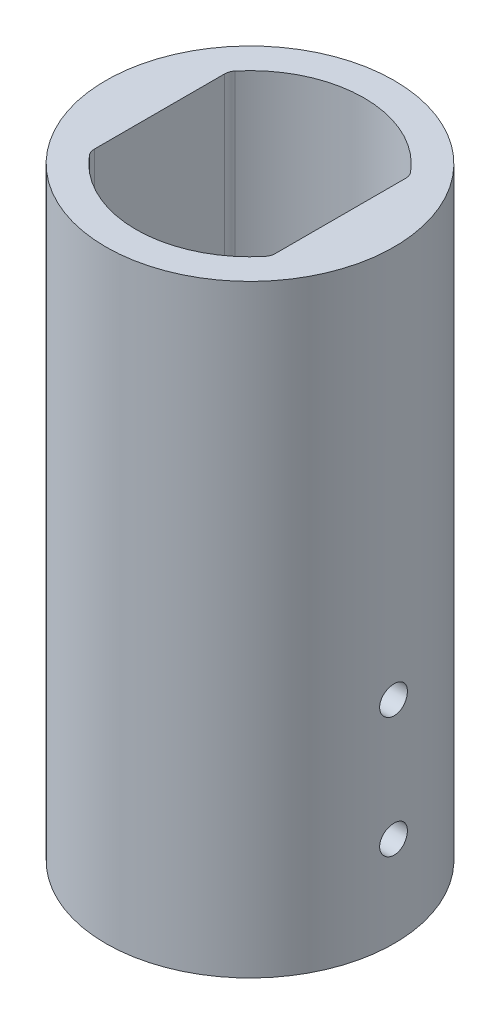
ISO-10303-21;
HEADER;
FILE_DESCRIPTION(('STEP AP214'),'2;1');
FILE_NAME('part.step','',(''),(''),'','','');
FILE_SCHEMA(('AUTOMOTIVE_DESIGN { 1 0 10303 214 1 1 1 1 }'));
ENDSEC;
DATA;
#1=APPLICATION_CONTEXT('core data for automotive mechanical design processes');
#2=APPLICATION_PROTOCOL_DEFINITION('international standard','automotive_design',2000,#1);
#3=PRODUCT_CONTEXT('',#1,'mechanical');
#4=PRODUCT('Part','Part','',(#3));
#5=PRODUCT_RELATED_PRODUCT_CATEGORY('part','',(#4));
#6=PRODUCT_DEFINITION_FORMATION('','',#4);
#7=PRODUCT_DEFINITION_CONTEXT('part definition',#1,'design');
#8=PRODUCT_DEFINITION('design','',#6,#7);
#9=PRODUCT_DEFINITION_SHAPE('','',#8);
#10=(LENGTH_UNIT() NAMED_UNIT(*) SI_UNIT(.MILLI.,.METRE.));
#11=(NAMED_UNIT(*) PLANE_ANGLE_UNIT() SI_UNIT($,.RADIAN.));
#12=(NAMED_UNIT(*) SI_UNIT($,.STERADIAN.) SOLID_ANGLE_UNIT());
#13=UNCERTAINTY_MEASURE_WITH_UNIT(LENGTH_MEASURE(1.E-05),#10,'distance_accuracy_value','');
#14=(GEOMETRIC_REPRESENTATION_CONTEXT(3) GLOBAL_UNCERTAINTY_ASSIGNED_CONTEXT((#13)) GLOBAL_UNIT_ASSIGNED_CONTEXT((#10,
#11,#12)) REPRESENTATION_CONTEXT('',''));
#15=CARTESIAN_POINT('',(0.,0.,0.));
#16=DIRECTION('',(0.,0.,1.));
#17=DIRECTION('',(1.,0.,0.));
#18=AXIS2_PLACEMENT_3D('',#15,#16,#17);
#19=CARTESIAN_POINT('',(0.,100.,0.));
#20=DIRECTION('',(0.,-1.,0.));
#21=DIRECTION('',(0.,0.,-1.));
#22=AXIS2_PLACEMENT_3D('',#19,#20,#21);
#23=CYLINDRICAL_SURFACE('',#22,18.9);
#24=CARTESIAN_POINT('',(0.,0.,0.));
#25=DIRECTION('',(0.,1.,0.));
#26=DIRECTION('',(0.,0.,1.));
#27=AXIS2_PLACEMENT_3D('',#24,#25,#26);
#28=CIRCLE('',#27,18.9);
#29=CARTESIAN_POINT('',(-14.5384615384615,0.,12.0765531545501));
#30=VERTEX_POINT('',#29);
#31=CARTESIAN_POINT('',(14.5384615384615,0.,12.0765531545501));
#32=VERTEX_POINT('',#31);
#33=EDGE_CURVE('E133',#30,#32,#28,.T.);
#34=ORIENTED_EDGE('',*,*,#33,.F.);
#35=DIRECTION('',(0.,-1.,0.));
#36=VECTOR('',#35,1.);
#37=CARTESIAN_POINT('',(-14.5384615384615,100.,12.0765531545501));
#38=LINE('',#37,#36);
#39=CARTESIAN_POINT('',(-14.5384615384615,100.,12.0765531545501));
#40=VERTEX_POINT('',#39);
#41=EDGE_CURVE('E157',#30,#40,#38,.F.);
#42=ORIENTED_EDGE('',*,*,#41,.T.);
#43=CARTESIAN_POINT('',(0.,100.,0.));
#44=DIRECTION('',(0.,1.,0.));
#45=DIRECTION('',(0.,0.,1.));
#46=AXIS2_PLACEMENT_3D('',#43,#44,#45);
#47=CIRCLE('',#46,18.9);
#48=CARTESIAN_POINT('',(14.5384615384615,100.,12.0765531545501));
#49=VERTEX_POINT('',#48);
#50=EDGE_CURVE('E209',#40,#49,#47,.T.);
#51=ORIENTED_EDGE('',*,*,#50,.T.);
#52=DIRECTION('',(0.,-1.,0.));
#53=VECTOR('',#52,1.);
#54=CARTESIAN_POINT('',(14.5384615384615,100.,12.0765531545501));
#55=LINE('',#54,#53);
#56=EDGE_CURVE('E142',#49,#32,#55,.T.);
#57=ORIENTED_EDGE('',*,*,#56,.T.);
#58=EDGE_LOOP('',(#34,#42,#51,#57));
#59=FACE_BOUND('',#58,.T.);
#60=ADVANCED_FACE('F43',(#59),#23,.F.);
#61=CARTESIAN_POINT('',(-15.,100.,0.));
#62=DIRECTION('',(1.,0.,0.));
#63=DIRECTION('',(0.,0.,-1.));
#64=AXIS2_PLACEMENT_3D('',#61,#62,#63);
#65=PLANE('',#64);
#66=CARTESIAN_POINT('',(-15.,15.,0.));
#67=DIRECTION('',(1.,0.,0.));
#68=DIRECTION('',(0.,0.,-1.));
#69=AXIS2_PLACEMENT_3D('',#66,#67,#68);
#70=CIRCLE('',#69,2.3);
#71=CARTESIAN_POINT('',(-15.,15.,-2.3));
#72=VERTEX_POINT('',#71);
#73=EDGE_CURVE('E282',#72,#72,#70,.T.);
#74=ORIENTED_EDGE('',*,*,#73,.F.);
#75=EDGE_LOOP('',(#74));
#76=FACE_BOUND('',#75,.T.);
#77=CARTESIAN_POINT('',(-15.,35.,0.));
#78=DIRECTION('',(1.,0.,0.));
#79=DIRECTION('',(0.,0.,-1.));
#80=AXIS2_PLACEMENT_3D('',#77,#78,#79);
#81=CIRCLE('',#80,2.3);
#82=CARTESIAN_POINT('',(-15.,35.,-2.3));
#83=VERTEX_POINT('',#82);
#84=EDGE_CURVE('E274',#83,#83,#81,.T.);
#85=ORIENTED_EDGE('',*,*,#84,.F.);
#86=EDGE_LOOP('',(#85));
#87=FACE_BOUND('',#86,.T.);
#88=DIRECTION('',(0.,0.,1.));
#89=VECTOR('',#88,1.);
#90=CARTESIAN_POINT('',(-15.,100.,0.));
#91=LINE('',#90,#89);
#92=CARTESIAN_POINT('',(-15.,100.,-10.7986110217935));
#93=VERTEX_POINT('',#92);
#94=CARTESIAN_POINT('',(-15.,100.,10.7986110217935));
#95=VERTEX_POINT('',#94);
#96=EDGE_CURVE('E207',#93,#95,#91,.T.);
#97=ORIENTED_EDGE('',*,*,#96,.T.);
#98=DIRECTION('',(0.,1.,0.));
#99=VECTOR('',#98,1.);
#100=CARTESIAN_POINT('',(-15.,0.,10.7986110217935));
#101=LINE('',#100,#99);
#102=CARTESIAN_POINT('',(-15.,0.,10.7986110217935));
#103=VERTEX_POINT('',#102);
#104=EDGE_CURVE('E131',#95,#103,#101,.F.);
#105=ORIENTED_EDGE('',*,*,#104,.T.);
#106=DIRECTION('',(0.,0.,1.));
#107=VECTOR('',#106,1.);
#108=CARTESIAN_POINT('',(-15.,0.,0.));
#109=LINE('',#108,#107);
#110=CARTESIAN_POINT('',(-15.,0.,-10.7986110217935));
#111=VERTEX_POINT('',#110);
#112=EDGE_CURVE('E113',#111,#103,#109,.T.);
#113=ORIENTED_EDGE('',*,*,#112,.F.);
#114=DIRECTION('',(0.,1.,0.));
#115=VECTOR('',#114,1.);
#116=CARTESIAN_POINT('',(-15.,100.,-10.7986110217935));
#117=LINE('',#116,#115);
#118=EDGE_CURVE('E128',#111,#93,#117,.T.);
#119=ORIENTED_EDGE('',*,*,#118,.T.);
#120=EDGE_LOOP('',(#97,#105,#113,#119));
#121=FACE_BOUND('',#120,.T.);
#122=ADVANCED_FACE('F127',(#76,#87,#121),#65,.T.);
#123=CARTESIAN_POINT('',(14.5384615384615,100.,-12.0765531545501));
#124=VERTEX_POINT('',#123);
#125=CARTESIAN_POINT('',(-14.5384615384615,100.,-12.0765531545501));
#126=VERTEX_POINT('',#125);
#127=EDGE_CURVE('E200',#124,#126,#47,.T.);
#128=ORIENTED_EDGE('',*,*,#127,.T.);
#129=DIRECTION('',(0.,-1.,0.));
#130=VECTOR('',#129,1.);
#131=CARTESIAN_POINT('',(-14.5384615384615,100.,-12.0765531545501));
#132=LINE('',#131,#130);
#133=CARTESIAN_POINT('',(-14.5384615384615,0.,-12.0765531545501));
#134=VERTEX_POINT('',#133);
#135=EDGE_CURVE('E163',#126,#134,#132,.T.);
#136=ORIENTED_EDGE('',*,*,#135,.T.);
#137=CARTESIAN_POINT('',(14.5384615384615,0.,-12.0765531545501));
#138=VERTEX_POINT('',#137);
#139=EDGE_CURVE('E115',#138,#134,#28,.T.);
#140=ORIENTED_EDGE('',*,*,#139,.F.);
#141=DIRECTION('',(0.,-1.,0.));
#142=VECTOR('',#141,1.);
#143=CARTESIAN_POINT('',(14.5384615384615,100.,-12.0765531545501));
#144=LINE('',#143,#142);
#145=EDGE_CURVE('E160',#138,#124,#144,.F.);
#146=ORIENTED_EDGE('',*,*,#145,.T.);
#147=EDGE_LOOP('',(#128,#136,#140,#146));
#148=FACE_BOUND('',#147,.T.);
#149=ADVANCED_FACE('F192',(#148),#23,.F.);
#150=CARTESIAN_POINT('',(15.,100.,0.));
#151=DIRECTION('',(1.,0.,0.));
#152=DIRECTION('',(0.,0.,-1.));
#153=AXIS2_PLACEMENT_3D('',#150,#151,#152);
#154=PLANE('',#153);
#155=CARTESIAN_POINT('',(15.,15.,0.));
#156=DIRECTION('',(1.,0.,0.));
#157=DIRECTION('',(0.,0.,-1.));
#158=AXIS2_PLACEMENT_3D('',#155,#156,#157);
#159=CIRCLE('',#158,2.3);
#160=CARTESIAN_POINT('',(15.,15.,-2.3));
#161=VERTEX_POINT('',#160);
#162=EDGE_CURVE('E268',#161,#161,#159,.T.);
#163=ORIENTED_EDGE('',*,*,#162,.T.);
#164=EDGE_LOOP('',(#163));
#165=FACE_BOUND('',#164,.T.);
#166=CARTESIAN_POINT('',(15.,35.,0.));
#167=DIRECTION('',(1.,0.,0.));
#168=DIRECTION('',(0.,0.,-1.));
#169=AXIS2_PLACEMENT_3D('',#166,#167,#168);
#170=CIRCLE('',#169,2.3);
#171=CARTESIAN_POINT('',(15.,35.,-2.3));
#172=VERTEX_POINT('',#171);
#173=EDGE_CURVE('E271',#172,#172,#170,.T.);
#174=ORIENTED_EDGE('',*,*,#173,.T.);
#175=EDGE_LOOP('',(#174));
#176=FACE_BOUND('',#175,.T.);
#177=DIRECTION('',(0.,0.,1.));
#178=VECTOR('',#177,1.);
#179=CARTESIAN_POINT('',(15.,0.,0.));
#180=LINE('',#179,#178);
#181=CARTESIAN_POINT('',(15.,0.,-10.7986110217935));
#182=VERTEX_POINT('',#181);
#183=CARTESIAN_POINT('',(15.,0.,10.7986110217935));
#184=VERTEX_POINT('',#183);
#185=EDGE_CURVE('E186',#182,#184,#180,.T.);
#186=ORIENTED_EDGE('',*,*,#185,.T.);
#187=DIRECTION('',(0.,-1.,0.));
#188=VECTOR('',#187,1.);
#189=CARTESIAN_POINT('',(15.,100.,10.7986110217935));
#190=LINE('',#189,#188);
#191=CARTESIAN_POINT('',(15.,100.,10.7986110217935));
#192=VERTEX_POINT('',#191);
#193=EDGE_CURVE('E59',#184,#192,#190,.F.);
#194=ORIENTED_EDGE('',*,*,#193,.T.);
#195=DIRECTION('',(0.,0.,1.));
#196=VECTOR('',#195,1.);
#197=CARTESIAN_POINT('',(15.,100.,0.));
#198=LINE('',#197,#196);
#199=CARTESIAN_POINT('',(15.,100.,-10.7986110217935));
#200=VERTEX_POINT('',#199);
#201=EDGE_CURVE('E196',#200,#192,#198,.T.);
#202=ORIENTED_EDGE('',*,*,#201,.F.);
#203=DIRECTION('',(0.,-1.,0.));
#204=VECTOR('',#203,1.);
#205=CARTESIAN_POINT('',(15.,100.,-10.7986110217935));
#206=LINE('',#205,#204);
#207=EDGE_CURVE('E166',#200,#182,#206,.T.);
#208=ORIENTED_EDGE('',*,*,#207,.T.);
#209=EDGE_LOOP('',(#186,#194,#202,#208));
#210=FACE_BOUND('',#209,.T.);
#211=ADVANCED_FACE('F195',(#165,#176,#210),#154,.F.);
#212=CARTESIAN_POINT('',(0.,100.,0.));
#213=DIRECTION('',(0.,-1.,0.));
#214=DIRECTION('',(0.,0.,-1.));
#215=AXIS2_PLACEMENT_3D('',#212,#213,#214);
#216=CYLINDRICAL_SURFACE('',#215,23.9);
#217=CARTESIAN_POINT('',(-23.9,12.7,0.));
#218=CARTESIAN_POINT('',(-23.8999985672061,12.7000055929058,-0.128872230972605));
#219=CARTESIAN_POINT('',(-23.8989465690738,12.7108677971494,-0.257830277154595));
#220=CARTESIAN_POINT('',(-23.894851095696,12.7540362637152,-0.512172892748667));
#221=CARTESIAN_POINT('',(-23.8918054114233,12.7863663132309,-0.637553337131763));
#222=CARTESIAN_POINT('',(-23.8840664593269,12.8715221011429,-0.881020662244166));
#223=CARTESIAN_POINT('',(-23.8793741715802,12.9243356494915,-0.999111832573301));
#224=CARTESIAN_POINT('',(-23.8688670628722,13.0489360271797,-1.22472696766789));
#225=CARTESIAN_POINT('',(-23.8630524692661,13.1207190147982,-1.33225306604665));
#226=CARTESIAN_POINT('',(-23.8509306139061,13.2814786551111,-1.53407185173555));
#227=CARTESIAN_POINT('',(-23.8446219390942,13.3705057809238,-1.62832425331403));
#228=CARTESIAN_POINT('',(-23.8322346737059,13.5631190858127,-1.800574045291));
#229=CARTESIAN_POINT('',(-23.8261560936497,13.6667059295513,-1.87857069319784));
#230=CARTESIAN_POINT('',(-23.8149026573076,13.8857485890693,-2.01623625677914));
#231=CARTESIAN_POINT('',(-23.8097295959098,14.0012272730351,-2.07586894568675));
#232=CARTESIAN_POINT('',(-23.8008901453461,14.2406168389981,-2.17488250242813));
#233=CARTESIAN_POINT('',(-23.797223721535,14.3645275270236,-2.21426383595039));
#234=CARTESIAN_POINT('',(-23.7918252562123,14.6168543815431,-2.27153791479931));
#235=CARTESIAN_POINT('',(-23.7900872235024,14.7452553078981,-2.2894972279951));
#236=CARTESIAN_POINT('',(-23.7887236555611,15.00325983418,-2.30362321090833));
#237=CARTESIAN_POINT('',(-23.7890980686512,15.1328634046083,-2.29979041374429));
#238=CARTESIAN_POINT('',(-23.7919116228644,15.3891360270471,-2.27049587663545));
#239=CARTESIAN_POINT('',(-23.7943438332959,15.5158134648615,-2.2451067377578));
#240=CARTESIAN_POINT('',(-23.8009880975228,15.7631007544195,-2.17353314570594));
#241=CARTESIAN_POINT('',(-23.8052001737596,15.8837105296376,-2.12734843033061));
#242=CARTESIAN_POINT('',(-23.8149375522509,16.1156686577129,-2.01541428455724));
#243=CARTESIAN_POINT('',(-23.8204650193691,16.2270013301704,-1.94963255606358));
#244=CARTESIAN_POINT('',(-23.8322085048326,16.4370733667284,-1.8003949117552));
#245=CARTESIAN_POINT('',(-23.8384245418302,16.5358123895318,-1.71693851710729));
#246=CARTESIAN_POINT('',(-23.8508756500325,16.718316231955,-1.53431465458612));
#247=CARTESIAN_POINT('',(-23.8571106954143,16.8020183092965,-1.43508447108696));
#248=CARTESIAN_POINT('',(-23.8688732883478,16.9515862530946,-1.22394783206344));
#249=CARTESIAN_POINT('',(-23.8744008351923,17.0174521017263,-1.11204136387087));
#250=CARTESIAN_POINT('',(-23.8841272489602,17.1294750461368,-0.878685948075916));
#251=CARTESIAN_POINT('',(-23.888325907839,17.1756290563148,-0.75723551002465));
#252=CARTESIAN_POINT('',(-23.8949192911087,17.2468726949626,-0.50825975271132));
#253=CARTESIAN_POINT('',(-23.8973140654489,17.2719629066892,-0.38073460176148));
#254=CARTESIAN_POINT('',(-23.9000234389768,17.3002873583688,-0.123772857945435));
#255=CARTESIAN_POINT('',(-23.9003462803333,17.3036081982201,0.00565410590416365));
#256=CARTESIAN_POINT('',(-23.8988974920686,17.2885269493404,0.263222792596815));
#257=CARTESIAN_POINT('',(-23.8971258886186,17.2701251320455,0.391364531479252));
#258=CARTESIAN_POINT('',(-23.8916926113398,17.2121927571613,0.642476074205561));
#259=CARTESIAN_POINT('',(-23.8880345563822,17.1727026491259,0.765455294830839));
#260=CARTESIAN_POINT('',(-23.8792388908754,17.0737561792389,1.00304333933314));
#261=CARTESIAN_POINT('',(-23.8741012494867,17.0142994012105,1.11765198867688));
#262=CARTESIAN_POINT('',(-23.862900853161,16.8768918926729,1.33563773638552));
#263=CARTESIAN_POINT('',(-23.8568352673294,16.7988841503593,1.438978749535));
#264=CARTESIAN_POINT('',(-23.8444689896744,16.6266709592416,1.63113072589424));
#265=CARTESIAN_POINT('',(-23.8381682923951,16.5324651343695,1.71994135166117));
#266=CARTESIAN_POINT('',(-23.826017215627,16.3301525701799,1.8808113553818));
#267=CARTESIAN_POINT('',(-23.8201684053207,16.2220005920219,1.95281397544649));
#268=CARTESIAN_POINT('',(-23.8096068196382,15.9950893839311,2.07763414337917));
#269=CARTESIAN_POINT('',(-23.8048940297252,15.876330289757,2.13045193674698));
#270=CARTESIAN_POINT('',(-23.797147658773,15.6317721595228,2.21530772630544));
#271=CARTESIAN_POINT('',(-23.7941113309366,15.5059850132577,2.24737972829705));
#272=CARTESIAN_POINT('',(-23.7900529864969,15.2507803123363,2.28994395885938));
#273=CARTESIAN_POINT('',(-23.7890309167667,15.1213628535225,2.30043675659235));
#274=CARTESIAN_POINT('',(-23.7891178496685,14.8631353211539,2.29953715282618));
#275=CARTESIAN_POINT('',(-23.7902181700639,14.7343249247485,2.28823391423022));
#276=CARTESIAN_POINT('',(-23.7944074083354,14.480441726994,2.24424979658284));
#277=CARTESIAN_POINT('',(-23.797496328661,14.3553689302489,2.21156889119876));
#278=CARTESIAN_POINT('',(-23.8053123453428,14.1125104312908,2.12578126174791));
#279=CARTESIAN_POINT('',(-23.8100392507747,13.9947238816745,2.07267691816653));
#280=CARTESIAN_POINT('',(-23.8205990151742,13.7697221387804,1.94755919486644));
#281=CARTESIAN_POINT('',(-23.8264318652658,13.6625068606696,1.87554596690568));
#282=CARTESIAN_POINT('',(-23.8385748500153,13.4612342026992,1.71431960002719));
#283=CARTESIAN_POINT('',(-23.8448867675235,13.3672300987724,1.6250400852698));
#284=CARTESIAN_POINT('',(-23.8572603863862,13.1954972756698,1.43194485048354));
#285=CARTESIAN_POINT('',(-23.8633220273003,13.1177724696101,1.32812564547907));
#286=CARTESIAN_POINT('',(-23.8745267500242,12.9806629745133,1.10863329606027));
#287=CARTESIAN_POINT('',(-23.8796676334151,12.9213219390023,0.992932792273184));
#288=CARTESIAN_POINT('',(-23.8884273297115,12.8229881838717,0.753235507748115));
#289=CARTESIAN_POINT('',(-23.8920478659587,12.7839724130473,0.629248306014286));
#290=CARTESIAN_POINT('',(-23.8964444241465,12.7371757611535,0.420459933415131));
#291=CARTESIAN_POINT('',(-23.8977715833696,12.7232537725771,0.336995471077471));
#292=CARTESIAN_POINT('',(-23.8995498395808,12.7046640749953,0.169032978175776));
#293=CARTESIAN_POINT('',(-23.9000009398546,12.6999963312809,0.0845349514894442));
#294=CARTESIAN_POINT('',(-23.9,12.7,0.));
#295=B_SPLINE_CURVE_WITH_KNOTS('',3,(#217,#218,#219,#220,#221,#222,#223,#224,#225,#226,#227,
#228,#229,#230,#231,#232,#233,#234,#235,#236,#237,#238,#239,#240,#241,#242,#243,#244,#245,#246,
#247,#248,#249,#250,#251,#252,#253,#254,#255,#256,#257,#258,#259,#260,#261,#262,#263,#264,#265,
#266,#267,#268,#269,#270,#271,#272,#273,#274,#275,#276,#277,#278,#279,#280,#281,#282,#283,#284,
#285,#286,#287,#288,#289,#290,#291,#292,#293,#294),.UNSPECIFIED.,.T.,.F.,(4,2,2,2,2,2,2,2,2,2,2,
2,2,2,2,2,2,2,2,2,2,2,2,2,2,2,2,2,2,2,2,2,2,2,2,2,2,2,4),(0.,0.386308013888013,
0.773044787691418,1.15955176072641,1.5459805176616,1.93355791577206,2.32115301284335,
2.70950789572854,3.09785384782918,3.48498986385391,3.87211640908921,4.25794427308729,
4.64377700193387,5.0302491782464,5.41673182600896,5.80479141800497,6.19285139781715,
6.58097210051429,6.96908205578896,7.35564714401819,7.74220740196458,8.12802884607991,
8.513858332594,8.90088925356509,9.28792916137665,9.67625772063646,10.064581310451,
10.4522667494301,10.8399419628819,11.2260346441692,11.6121278010401,11.9981759698586,
12.3842210404465,12.7717807716331,13.1594335553632,13.5479999139015,13.9361246285081,
14.1895279524865,14.4429303260432),.UNSPECIFIED.);
#296=CARTESIAN_POINT('',(-23.9,12.7,0.));
#297=VERTEX_POINT('',#296);
#298=EDGE_CURVE('E138',#297,#297,#295,.T.);
#299=ORIENTED_EDGE('',*,*,#298,.T.);
#300=EDGE_LOOP('',(#299));
#301=FACE_BOUND('',#300,.T.);
#302=CARTESIAN_POINT('',(23.7890731219188,15.,-2.3));
#303=CARTESIAN_POINT('',(23.7890745796133,14.8711293269885,-2.29999440569837));
#304=CARTESIAN_POINT('',(23.790131586134,14.7421728338327,-2.28913245520896));
#305=CARTESIAN_POINT('',(23.7942449506401,14.4878334450125,-2.24596508820164));
#306=CARTESIAN_POINT('',(23.797303526949,14.362454675597,-2.2136358791101));
#307=CARTESIAN_POINT('',(23.8050704428709,14.1189908921669,-2.12848254972182));
#308=CARTESIAN_POINT('',(23.8097777978512,14.0009015743695,-2.0756706594432));
#309=CARTESIAN_POINT('',(23.820310654267,13.7752895430518,-1.95107418634971));
#310=CARTESIAN_POINT('',(23.8261359294674,13.6677646982297,-1.87929344118266));
#311=CARTESIAN_POINT('',(23.8382703165305,13.4659444960032,-1.71853606565482));
#312=CARTESIAN_POINT('',(23.8445808283442,13.3716898216312,-1.62950846122631));
#313=CARTESIAN_POINT('',(23.8569619201748,13.1994356434251,-1.4368932449574));
#314=CARTESIAN_POINT('',(23.863032489325,13.1214368751117,-1.33330497465477));
#315=CARTESIAN_POINT('',(23.8742634170107,12.98376909502,-1.11426106624565));
#316=CARTESIAN_POINT('',(23.8794219877009,12.9241359203515,-0.998782805263267));
#317=CARTESIAN_POINT('',(23.8882324844159,12.8251213488409,-0.759394158676584));
#318=CARTESIAN_POINT('',(23.8918844446569,12.7857394920714,-0.635483964642178));
#319=CARTESIAN_POINT('',(23.8972604262711,12.7284643186578,-0.383158618265516));
#320=CARTESIAN_POINT('',(23.8989904229893,12.7105043887896,-0.254758715742679));
#321=CARTESIAN_POINT('',(23.9003478595699,12.6963768178066,0.00324380621287873));
#322=CARTESIAN_POINT('',(23.8999753502255,12.7002086502374,0.132846396515046));
#323=CARTESIAN_POINT('',(23.8971746464111,12.729501661128,0.38912327673305));
#324=CARTESIAN_POINT('',(23.8947532598505,12.7548912096216,0.51580583889174));
#325=CARTESIAN_POINT('',(23.888134804395,12.8264673975964,0.763103165693198));
#326=CARTESIAN_POINT('',(23.883937713903,12.872654290028,0.883717856514829));
#327=CARTESIAN_POINT('',(23.874228085727,12.9845929411124,1.11568193875805));
#328=CARTESIAN_POINT('',(23.8687134135587,13.0503764895093,1.22701589647157));
#329=CARTESIAN_POINT('',(23.856987641652,13.1996180167383,1.43708973147915));
#330=CARTESIAN_POINT('',(23.8507765230112,13.2830764753444,1.53582926678906));
#331=CARTESIAN_POINT('',(23.8383254052756,13.4657018003236,1.71833077342468));
#332=CARTESIAN_POINT('',(23.8320853911564,13.5649309613168,1.80203041933817));
#333=CARTESIAN_POINT('',(23.8203049386912,13.7760646887908,1.95159394482695));
#334=CARTESIAN_POINT('',(23.8147645012413,13.8879692715053,2.01745780155921));
#335=CARTESIAN_POINT('',(23.8050098847077,14.1213241798396,2.12947931364934));
#336=CARTESIAN_POINT('',(23.8007959547677,14.242776293324,2.17563326768483));
#337=CARTESIAN_POINT('',(23.794176566738,14.4917556919129,2.24687628048716));
#338=CARTESIAN_POINT('',(23.7917710577035,14.6192828057716,2.2719659326566));
#339=CARTESIAN_POINT('',(23.7890495682426,14.8762454574254,2.30028827432174));
#340=CARTESIAN_POINT('',(23.7887252587095,15.0056713076769,2.30360808940539));
#341=CARTESIAN_POINT('',(23.7901809076655,15.2632375208693,2.28852518848825));
#342=CARTESIAN_POINT('',(23.7919608398584,15.3913778998542,2.27012274394397));
#343=CARTESIAN_POINT('',(23.7974168376376,15.6424827048456,2.21219053266803));
#344=CARTESIAN_POINT('',(23.8010892170999,15.7654566922089,2.17270183251806));
#345=CARTESIAN_POINT('',(23.8099133191651,16.0030348931961,2.07375993139672));
#346=CARTESIAN_POINT('',(23.8150650732208,16.1176389288033,2.01430630595067));
#347=CARTESIAN_POINT('',(23.8262876226937,16.3356215399853,1.8769034336379));
#348=CARTESIAN_POINT('',(23.8323612688982,16.438963524869,1.79889637394515));
#349=CARTESIAN_POINT('',(23.8447338526458,16.6311177798882,1.6266839830473));
#350=CARTESIAN_POINT('',(23.8510327953511,16.719929716835,1.53247828049246));
#351=CARTESIAN_POINT('',(23.8631713017045,16.8808025438397,1.33016514241423));
#352=CARTESIAN_POINT('',(23.8690092653138,16.9528066522353,1.22201244662623));
#353=CARTESIAN_POINT('',(23.879544796908,17.077629431727,0.995099407365649));
#354=CARTESIAN_POINT('',(23.8842423795101,17.1304483487395,0.876339199884757));
#355=CARTESIAN_POINT('',(23.891960600547,17.2153048835754,0.631781780557302));
#356=CARTESIAN_POINT('',(23.8949840211513,17.2473769940414,0.505996628334338));
#357=CARTESIAN_POINT('',(23.8990246485449,17.2899421172658,0.250796132080333));
#358=CARTESIAN_POINT('',(23.900041907259,17.3004356885357,0.12138088209402));
#359=CARTESIAN_POINT('',(23.8999555930434,17.2995383371418,-0.136847985947302));
#360=CARTESIAN_POINT('',(23.8988605705048,17.2882356445351,-0.265661922576299));
#361=CARTESIAN_POINT('',(23.8946896069771,17.2442513732906,-0.519552336873272));
#362=CARTESIAN_POINT('',(23.8916136641281,17.2115697745796,-0.644628811031956));
#363=CARTESIAN_POINT('',(23.8838256080255,17.1257793755473,-0.887494666352846));
#364=CARTESIAN_POINT('',(23.8791136829313,17.0726729242752,-1.00528488369507));
#365=CARTESIAN_POINT('',(23.868579362554,16.9475498504393,-1.23029308221473));
#366=CARTESIAN_POINT('',(23.8627569764214,16.8755333836954,-1.3375111504975));
#367=CARTESIAN_POINT('',(23.8506261419168,16.714303458664,-1.53878363600276));
#368=CARTESIAN_POINT('',(23.8443158954027,16.6250243650006,-1.63278536818185));
#369=CARTESIAN_POINT('',(23.831935800759,16.4319309477148,-1.80451360279787));
#370=CARTESIAN_POINT('',(23.8258660108056,16.3281131338048,-1.88223618591026));
#371=CARTESIAN_POINT('',(23.8146385800192,16.108621913778,-2.01934329331646));
#372=CARTESIAN_POINT('',(23.8094831429344,15.9929208981119,-2.07868376356034));
#373=CARTESIAN_POINT('',(23.8006945177772,15.7532225270002,-2.17701632000534));
#374=CARTESIAN_POINT('',(23.7970596056051,15.6292347538822,-2.21603146516766));
#375=CARTESIAN_POINT('',(23.7926446673027,15.4204480557667,-2.26282635100699));
#376=CARTESIAN_POINT('',(23.7913116285386,15.3369859641592,-2.27674754474078));
#377=CARTESIAN_POINT('',(23.7895253794372,15.1690282209873,-2.29533618638568));
#378=CARTESIAN_POINT('',(23.7890721657457,15.0845325733645,-2.30000366957588));
#379=CARTESIAN_POINT('',(23.7890731219188,15.,-2.3));
#380=B_SPLINE_CURVE_WITH_KNOTS('',3,(#302,#303,#304,#305,#306,#307,#308,#309,#310,#311,#312,
#313,#314,#315,#316,#317,#318,#319,#320,#321,#322,#323,#324,#325,#326,#327,#328,#329,#330,#331,
#332,#333,#334,#335,#336,#337,#338,#339,#340,#341,#342,#343,#344,#345,#346,#347,#348,#349,#350,
#351,#352,#353,#354,#355,#356,#357,#358,#359,#360,#361,#362,#363,#364,#365,#366,#367,#368,#369,
#370,#371,#372,#373,#374,#375,#376,#377,#378,#379),.UNSPECIFIED.,.T.,.F.,(4,2,2,2,2,2,2,2,2,2,2,
2,2,2,2,2,2,2,2,2,2,2,2,2,2,2,2,2,2,2,2,2,2,2,2,2,2,2,4),(0.,0.38630333420801,0.773035532016052,
1.15953717024883,1.54596067392172,1.93354419579912,2.32114525061545,2.70949791501501,
3.09784175915273,3.48497484181753,3.87209857199894,4.25794101472027,4.64378815042898,
5.0302646487657,5.41675163910486,5.80480504578152,6.19285894945202,6.58098569374924,
6.96910150375827,7.35566307319669,7.74221981194316,8.12802644248334,8.51384127618546,
8.90087444036553,9.2879164783649,9.67624772007165,10.0645739839619,10.4522529646086,
10.8399219109382,11.2260248885937,11.6121282287694,11.9981871767178,12.3842429436098,
12.7717964958129,13.1594432473956,13.548011960415,13.9361388792261,14.18953508391,
14.4429303225377),.UNSPECIFIED.);
#381=CARTESIAN_POINT('',(23.7890731219188,15.,-2.3));
#382=VERTEX_POINT('',#381);
#383=EDGE_CURVE('E145',#382,#382,#380,.T.);
#384=ORIENTED_EDGE('',*,*,#383,.T.);
#385=EDGE_LOOP('',(#384));
#386=FACE_BOUND('',#385,.T.);
#387=CARTESIAN_POINT('',(-23.9,32.7,0.));
#388=CARTESIAN_POINT('',(-23.8999985672061,32.7000055929058,-0.128872230972605));
#389=CARTESIAN_POINT('',(-23.8989465690738,32.7108677971494,-0.257830277154596));
#390=CARTESIAN_POINT('',(-23.894851095696,32.7540362637152,-0.512172892748668));
#391=CARTESIAN_POINT('',(-23.8918054114233,32.7863663132309,-0.637553337131764));
#392=CARTESIAN_POINT('',(-23.8840664593269,32.8715221011428,-0.881020662244167));
#393=CARTESIAN_POINT('',(-23.8793741715802,32.9243356494915,-0.999111832573303));
#394=CARTESIAN_POINT('',(-23.8688670628722,33.0489360271797,-1.22472696766789));
#395=CARTESIAN_POINT('',(-23.8630524692661,33.1207190147982,-1.33225306604665));
#396=CARTESIAN_POINT('',(-23.8509306139061,33.2814786551111,-1.53407185173555));
#397=CARTESIAN_POINT('',(-23.8446219390942,33.3705057809238,-1.62832425331404));
#398=CARTESIAN_POINT('',(-23.8322346737059,33.5631190858127,-1.80057404529101));
#399=CARTESIAN_POINT('',(-23.8261560936497,33.6667059295513,-1.87857069319784));
#400=CARTESIAN_POINT('',(-23.8149026573076,33.8857485890693,-2.01623625677914));
#401=CARTESIAN_POINT('',(-23.8097295959098,34.0012272730351,-2.07586894568675));
#402=CARTESIAN_POINT('',(-23.8008901453461,34.240616838998,-2.17488250242813));
#403=CARTESIAN_POINT('',(-23.797223721535,34.3645275270236,-2.21426383595039));
#404=CARTESIAN_POINT('',(-23.7918252562123,34.6168543815431,-2.27153791479932));
#405=CARTESIAN_POINT('',(-23.7900872235024,34.7452553078981,-2.2894972279951));
#406=CARTESIAN_POINT('',(-23.7887236555611,35.00325983418,-2.30362321090833));
#407=CARTESIAN_POINT('',(-23.7890980686512,35.1328634046083,-2.29979041374429));
#408=CARTESIAN_POINT('',(-23.7919116228644,35.3891360270471,-2.27049587663545));
#409=CARTESIAN_POINT('',(-23.7943438332959,35.5158134648615,-2.24510673775781));
#410=CARTESIAN_POINT('',(-23.8009880975228,35.7631007544195,-2.17353314570595));
#411=CARTESIAN_POINT('',(-23.8052001737596,35.8837105296376,-2.12734843033061));
#412=CARTESIAN_POINT('',(-23.8149375522509,36.1156686577129,-2.01541428455725));
#413=CARTESIAN_POINT('',(-23.8204650193691,36.2270013301704,-1.94963255606359));
#414=CARTESIAN_POINT('',(-23.8322085048326,36.4370733667284,-1.8003949117552));
#415=CARTESIAN_POINT('',(-23.8384245418302,36.5358123895318,-1.71693851710729));
#416=CARTESIAN_POINT('',(-23.8508756500325,36.718316231955,-1.53431465458612));
#417=CARTESIAN_POINT('',(-23.8571106954143,36.8020183092965,-1.43508447108696));
#418=CARTESIAN_POINT('',(-23.8688732883478,36.9515862530946,-1.22394783206345));
#419=CARTESIAN_POINT('',(-23.8744008351923,37.0174521017263,-1.11204136387087));
#420=CARTESIAN_POINT('',(-23.8841272489602,37.1294750461367,-0.878685948075918));
#421=CARTESIAN_POINT('',(-23.888325907839,37.1756290563148,-0.757235510024651));
#422=CARTESIAN_POINT('',(-23.8949192911087,37.2468726949626,-0.50825975271132));
#423=CARTESIAN_POINT('',(-23.8973140654489,37.2719629066892,-0.380734601761481));
#424=CARTESIAN_POINT('',(-23.9000234389768,37.3002873583688,-0.123772857945437));
#425=CARTESIAN_POINT('',(-23.9003462803333,37.3036081982201,0.00565410590416235));
#426=CARTESIAN_POINT('',(-23.8988974920686,37.2885269493405,0.263222792596815));
#427=CARTESIAN_POINT('',(-23.8971258886186,37.2701251320455,0.391364531479251));
#428=CARTESIAN_POINT('',(-23.8916926113398,37.2121927571613,0.642476074205561));
#429=CARTESIAN_POINT('',(-23.8880345563822,37.1727026491259,0.765455294830839));
#430=CARTESIAN_POINT('',(-23.8792388908754,37.0737561792389,1.00304333933314));
#431=CARTESIAN_POINT('',(-23.8741012494867,37.0142994012105,1.11765198867688));
#432=CARTESIAN_POINT('',(-23.862900853161,36.8768918926729,1.33563773638551));
#433=CARTESIAN_POINT('',(-23.8568352673294,36.7988841503593,1.438978749535));
#434=CARTESIAN_POINT('',(-23.8444689896744,36.6266709592416,1.63113072589424));
#435=CARTESIAN_POINT('',(-23.8381682923951,36.5324651343695,1.71994135166118));
#436=CARTESIAN_POINT('',(-23.826017215627,36.3301525701799,1.88081135538181));
#437=CARTESIAN_POINT('',(-23.8201684053207,36.2220005920219,1.95281397544649));
#438=CARTESIAN_POINT('',(-23.8096068196382,35.9950893839311,2.07763414337917));
#439=CARTESIAN_POINT('',(-23.8048940297252,35.876330289757,2.13045193674698));
#440=CARTESIAN_POINT('',(-23.797147658773,35.6317721595228,2.21530772630544));
#441=CARTESIAN_POINT('',(-23.7941113309366,35.5059850132577,2.24737972829705));
#442=CARTESIAN_POINT('',(-23.7900529864969,35.2507803123363,2.28994395885938));
#443=CARTESIAN_POINT('',(-23.7890309167667,35.1213628535225,2.30043675659236));
#444=CARTESIAN_POINT('',(-23.7891178496685,34.8631353211539,2.29953715282618));
#445=CARTESIAN_POINT('',(-23.7902181700639,34.7343249247485,2.28823391423022));
#446=CARTESIAN_POINT('',(-23.7944074083354,34.480441726994,2.24424979658284));
#447=CARTESIAN_POINT('',(-23.797496328661,34.3553689302489,2.21156889119876));
#448=CARTESIAN_POINT('',(-23.8053123453428,34.1125104312908,2.12578126174791));
#449=CARTESIAN_POINT('',(-23.8100392507747,33.9947238816745,2.07267691816653));
#450=CARTESIAN_POINT('',(-23.8205990151742,33.7697221387804,1.94755919486644));
#451=CARTESIAN_POINT('',(-23.8264318652658,33.6625068606696,1.87554596690568));
#452=CARTESIAN_POINT('',(-23.8385748500153,33.4612342026992,1.7143196000272));
#453=CARTESIAN_POINT('',(-23.8448867675235,33.3672300987724,1.62504008526981));
#454=CARTESIAN_POINT('',(-23.8572603863862,33.1954972756698,1.43194485048355));
#455=CARTESIAN_POINT('',(-23.8633220273003,33.1177724696101,1.32812564547907));
#456=CARTESIAN_POINT('',(-23.8745267500242,32.9806629745133,1.10863329606026));
#457=CARTESIAN_POINT('',(-23.8796676334151,32.9213219390023,0.992932792273183));
#458=CARTESIAN_POINT('',(-23.8884273297115,32.8229881838717,0.753235507748116));
#459=CARTESIAN_POINT('',(-23.8920478659587,32.7839724130473,0.629248306014287));
#460=CARTESIAN_POINT('',(-23.8964444241465,32.7371757611535,0.420459933415131));
#461=CARTESIAN_POINT('',(-23.8977715833696,32.7232537725771,0.33699547107747));
#462=CARTESIAN_POINT('',(-23.8995498395808,32.7046640749953,0.169032978175775));
#463=CARTESIAN_POINT('',(-23.9000009398546,32.6999963312809,0.0845349514894437));
#464=CARTESIAN_POINT('',(-23.9,32.7,0.));
#465=B_SPLINE_CURVE_WITH_KNOTS('',3,(#387,#388,#389,#390,#391,#392,#393,#394,#395,#396,#397,
#398,#399,#400,#401,#402,#403,#404,#405,#406,#407,#408,#409,#410,#411,#412,#413,#414,#415,#416,
#417,#418,#419,#420,#421,#422,#423,#424,#425,#426,#427,#428,#429,#430,#431,#432,#433,#434,#435,
#436,#437,#438,#439,#440,#441,#442,#443,#444,#445,#446,#447,#448,#449,#450,#451,#452,#453,#454,
#455,#456,#457,#458,#459,#460,#461,#462,#463,#464),.UNSPECIFIED.,.T.,.F.,(4,2,2,2,2,2,2,2,2,2,2,
2,2,2,2,2,2,2,2,2,2,2,2,2,2,2,2,2,2,2,2,2,2,2,2,2,2,2,4),(0.,0.386308013888014,
0.773044787691418,1.15955176072642,1.5459805176616,1.93355791577206,2.32115301284335,
2.70950789572854,3.09785384782918,3.4849898638539,3.87211640908922,4.25794427308728,
4.64377700193387,5.03024917824639,5.41673182600896,5.80479141800497,6.19285139781716,
6.58097210051429,6.96908205578896,7.3556471440182,7.74220740196458,8.12802884607992,
8.51385833259401,8.9008892535651,9.28792916137666,9.67625772063646,10.064581310451,
10.4522667494302,10.8399419628819,11.2260346441692,11.6121278010401,11.9981759698586,
12.3842210404465,12.7717807716331,13.1594335553632,13.5479999139015,13.9361246285081,
14.1895279524865,14.4429303260432),.UNSPECIFIED.);
#466=CARTESIAN_POINT('',(-23.9,32.7,0.));
#467=VERTEX_POINT('',#466);
#468=EDGE_CURVE('E225',#467,#467,#465,.T.);
#469=ORIENTED_EDGE('',*,*,#468,.T.);
#470=EDGE_LOOP('',(#469));
#471=FACE_BOUND('',#470,.T.);
#472=CARTESIAN_POINT('',(23.7890731219188,35.,-2.3));
#473=CARTESIAN_POINT('',(23.7890745796133,34.8711293269885,-2.29999440569837));
#474=CARTESIAN_POINT('',(23.790131586134,34.7421728338327,-2.28913245520896));
#475=CARTESIAN_POINT('',(23.7942449506401,34.4878334450125,-2.24596508820164));
#476=CARTESIAN_POINT('',(23.797303526949,34.362454675597,-2.2136358791101));
#477=CARTESIAN_POINT('',(23.8050704428709,34.1189908921669,-2.12848254972182));
#478=CARTESIAN_POINT('',(23.8097777978512,34.0009015743695,-2.0756706594432));
#479=CARTESIAN_POINT('',(23.820310654267,33.7752895430518,-1.95107418634971));
#480=CARTESIAN_POINT('',(23.8261359294674,33.6677646982297,-1.87929344118266));
#481=CARTESIAN_POINT('',(23.8382703165305,33.4659444960031,-1.71853606565482));
#482=CARTESIAN_POINT('',(23.8445808283442,33.3716898216312,-1.62950846122631));
#483=CARTESIAN_POINT('',(23.8569619201748,33.1994356434251,-1.43689324495741));
#484=CARTESIAN_POINT('',(23.863032489325,33.1214368751117,-1.33330497465477));
#485=CARTESIAN_POINT('',(23.8742634170107,32.9837690950199,-1.11426106624565));
#486=CARTESIAN_POINT('',(23.8794219877009,32.9241359203515,-0.998782805263268));
#487=CARTESIAN_POINT('',(23.8882324844159,32.8251213488409,-0.759394158676586));
#488=CARTESIAN_POINT('',(23.8918844446569,32.7857394920714,-0.63548396464218));
#489=CARTESIAN_POINT('',(23.8972604262711,32.7284643186578,-0.383158618265517));
#490=CARTESIAN_POINT('',(23.8989904229893,32.7105043887896,-0.25475871574268));
#491=CARTESIAN_POINT('',(23.9003478595699,32.6963768178066,0.00324380621287863));
#492=CARTESIAN_POINT('',(23.8999753502255,32.7002086502373,0.132846396515047));
#493=CARTESIAN_POINT('',(23.8971746464111,32.729501661128,0.389123276733051));
#494=CARTESIAN_POINT('',(23.8947532598505,32.7548912096216,0.51580583889174));
#495=CARTESIAN_POINT('',(23.888134804395,32.8264673975964,0.763103165693199));
#496=CARTESIAN_POINT('',(23.883937713903,32.872654290028,0.88371785651483));
#497=CARTESIAN_POINT('',(23.874228085727,32.9845929411124,1.11568193875805));
#498=CARTESIAN_POINT('',(23.8687134135587,33.0503764895093,1.22701589647158));
#499=CARTESIAN_POINT('',(23.856987641652,33.1996180167382,1.43708973147915));
#500=CARTESIAN_POINT('',(23.8507765230112,33.2830764753444,1.53582926678906));
#501=CARTESIAN_POINT('',(23.8383254052756,33.4657018003235,1.71833077342468));
#502=CARTESIAN_POINT('',(23.8320853911564,33.5649309613168,1.80203041933817));
#503=CARTESIAN_POINT('',(23.8203049386912,33.7760646887908,1.95159394482696));
#504=CARTESIAN_POINT('',(23.8147645012413,33.8879692715053,2.01745780155922));
#505=CARTESIAN_POINT('',(23.8050098847077,34.1213241798396,2.12947931364934));
#506=CARTESIAN_POINT('',(23.8007959547677,34.242776293324,2.17563326768483));
#507=CARTESIAN_POINT('',(23.794176566738,34.4917556919129,2.24687628048717));
#508=CARTESIAN_POINT('',(23.7917710577035,34.6192828057716,2.2719659326566));
#509=CARTESIAN_POINT('',(23.7890495682426,34.8762454574254,2.30028827432174));
#510=CARTESIAN_POINT('',(23.7887252587095,35.0056713076769,2.30360808940539));
#511=CARTESIAN_POINT('',(23.7901809076655,35.2632375208693,2.28852518848826));
#512=CARTESIAN_POINT('',(23.7919608398584,35.3913778998542,2.27012274394398));
#513=CARTESIAN_POINT('',(23.7974168376376,35.6424827048456,2.21219053266804));
#514=CARTESIAN_POINT('',(23.8010892170999,35.7654566922089,2.17270183251806));
#515=CARTESIAN_POINT('',(23.8099133191651,36.0030348931961,2.07375993139672));
#516=CARTESIAN_POINT('',(23.8150650732208,36.1176389288033,2.01430630595067));
#517=CARTESIAN_POINT('',(23.8262876226937,36.3356215399853,1.8769034336379));
#518=CARTESIAN_POINT('',(23.8323612688982,36.438963524869,1.79889637394516));
#519=CARTESIAN_POINT('',(23.8447338526458,36.6311177798882,1.62668398304731));
#520=CARTESIAN_POINT('',(23.8510327953511,36.719929716835,1.53247828049247));
#521=CARTESIAN_POINT('',(23.8631713017045,36.8808025438397,1.33016514241423));
#522=CARTESIAN_POINT('',(23.8690092653138,36.9528066522353,1.22201244662624));
#523=CARTESIAN_POINT('',(23.879544796908,37.077629431727,0.99509940736565));
#524=CARTESIAN_POINT('',(23.8842423795101,37.1304483487395,0.876339199884758));
#525=CARTESIAN_POINT('',(23.891960600547,37.2153048835754,0.631781780557303));
#526=CARTESIAN_POINT('',(23.8949840211513,37.2473769940414,0.505996628334339));
#527=CARTESIAN_POINT('',(23.8990246485449,37.2899421172659,0.250796132080332));
#528=CARTESIAN_POINT('',(23.900041907259,37.3004356885358,0.121380882094019));
#529=CARTESIAN_POINT('',(23.8999555930434,37.2995383371418,-0.136847985947302));
#530=CARTESIAN_POINT('',(23.8988605705048,37.2882356445351,-0.265661922576299));
#531=CARTESIAN_POINT('',(23.8946896069771,37.2442513732906,-0.519552336873271));
#532=CARTESIAN_POINT('',(23.8916136641281,37.2115697745796,-0.644628811031956));
#533=CARTESIAN_POINT('',(23.8838256080255,37.1257793755473,-0.887494666352847));
#534=CARTESIAN_POINT('',(23.8791136829313,37.0726729242752,-1.00528488369507));
#535=CARTESIAN_POINT('',(23.868579362554,36.9475498504393,-1.23029308221473));
#536=CARTESIAN_POINT('',(23.8627569764214,36.8755333836954,-1.3375111504975));
#537=CARTESIAN_POINT('',(23.8506261419168,36.714303458664,-1.53878363600276));
#538=CARTESIAN_POINT('',(23.8443158954027,36.6250243650006,-1.63278536818185));
#539=CARTESIAN_POINT('',(23.831935800759,36.4319309477148,-1.80451360279787));
#540=CARTESIAN_POINT('',(23.8258660108056,36.3281131338048,-1.88223618591027));
#541=CARTESIAN_POINT('',(23.8146385800192,36.108621913778,-2.01934329331646));
#542=CARTESIAN_POINT('',(23.8094831429344,35.9929208981119,-2.07868376356034));
#543=CARTESIAN_POINT('',(23.8006945177772,35.7532225270002,-2.17701632000534));
#544=CARTESIAN_POINT('',(23.7970596056051,35.6292347538822,-2.21603146516766));
#545=CARTESIAN_POINT('',(23.7926446673027,35.4204480557667,-2.26282635100699));
#546=CARTESIAN_POINT('',(23.7913116285386,35.3369859641592,-2.27674754474078));
#547=CARTESIAN_POINT('',(23.7895253794372,35.1690282209873,-2.29533618638568));
#548=CARTESIAN_POINT('',(23.7890721657457,35.0845325733645,-2.30000366957588));
#549=CARTESIAN_POINT('',(23.7890731219188,35.,-2.3));
#550=B_SPLINE_CURVE_WITH_KNOTS('',3,(#472,#473,#474,#475,#476,#477,#478,#479,#480,#481,#482,
#483,#484,#485,#486,#487,#488,#489,#490,#491,#492,#493,#494,#495,#496,#497,#498,#499,#500,#501,
#502,#503,#504,#505,#506,#507,#508,#509,#510,#511,#512,#513,#514,#515,#516,#517,#518,#519,#520,
#521,#522,#523,#524,#525,#526,#527,#528,#529,#530,#531,#532,#533,#534,#535,#536,#537,#538,#539,
#540,#541,#542,#543,#544,#545,#546,#547,#548,#549),.UNSPECIFIED.,.T.,.F.,(4,2,2,2,2,2,2,2,2,2,2,
2,2,2,2,2,2,2,2,2,2,2,2,2,2,2,2,2,2,2,2,2,2,2,2,2,2,2,4),(0.,0.386303334208008,
0.773035532016052,1.15953717024883,1.54596067392172,1.93354419579912,2.32114525061545,
2.70949791501501,3.09784175915273,3.48497484181753,3.87209857199895,4.25794101472027,
4.64378815042899,5.03026464876571,5.41675163910486,5.80480504578152,6.19285894945203,
6.58098569374926,6.96910150375828,7.35566307319669,7.74221981194317,8.12802644248334,
8.51384127618546,8.90087444036554,9.28791647836491,9.67624772007166,10.0645739839619,
10.4522529646086,10.8399219109382,11.2260248885937,11.6121282287694,11.9981871767179,
12.3842429436098,12.7717964958129,13.1594432473956,13.548011960415,13.9361388792261,
14.18953508391,14.4429303225377),.UNSPECIFIED.);
#551=CARTESIAN_POINT('',(23.7890731219188,35.,-2.3));
#552=VERTEX_POINT('',#551);
#553=EDGE_CURVE('E205',#552,#552,#550,.T.);
#554=ORIENTED_EDGE('',*,*,#553,.T.);
#555=EDGE_LOOP('',(#554));
#556=FACE_BOUND('',#555,.T.);
#557=CARTESIAN_POINT('',(0.,100.,0.));
#558=DIRECTION('',(0.,1.,0.));
#559=DIRECTION('',(0.,0.,1.));
#560=AXIS2_PLACEMENT_3D('',#557,#558,#559);
#561=CIRCLE('',#560,23.9);
#562=CARTESIAN_POINT('',(0.,100.,23.9));
#563=VERTEX_POINT('',#562);
#564=EDGE_CURVE('E199',#563,#563,#561,.T.);
#565=ORIENTED_EDGE('',*,*,#564,.F.);
#566=EDGE_LOOP('',(#565));
#567=FACE_BOUND('',#566,.T.);
#568=CARTESIAN_POINT('',(0.,0.,0.));
#569=DIRECTION('',(0.,1.,0.));
#570=DIRECTION('',(0.,0.,1.));
#571=AXIS2_PLACEMENT_3D('',#568,#569,#570);
#572=CIRCLE('',#571,23.9);
#573=CARTESIAN_POINT('',(0.,0.,23.9));
#574=VERTEX_POINT('',#573);
#575=EDGE_CURVE('E214',#574,#574,#572,.T.);
#576=ORIENTED_EDGE('',*,*,#575,.T.);
#577=EDGE_LOOP('',(#576));
#578=FACE_BOUND('',#577,.T.);
#579=ADVANCED_FACE('F229',(#301,#386,#471,#556,#567,#578),#216,.T.);
#580=CARTESIAN_POINT('',(0.,100.,0.));
#581=DIRECTION('',(0.,1.,0.));
#582=DIRECTION('',(0.,0.,1.));
#583=AXIS2_PLACEMENT_3D('',#580,#581,#582);
#584=PLANE('',#583);
#585=ORIENTED_EDGE('',*,*,#50,.F.);
#586=CARTESIAN_POINT('',(-13.,100.,10.7986110217935));
#587=DIRECTION('',(0.,1.,0.));
#588=DIRECTION('',(0.,0.,1.));
#589=AXIS2_PLACEMENT_3D('',#586,#587,#588);
#590=CIRCLE('',#589,2.);
#591=EDGE_CURVE('E122',#40,#95,#590,.F.);
#592=ORIENTED_EDGE('',*,*,#591,.T.);
#593=ORIENTED_EDGE('',*,*,#96,.F.);
#594=CARTESIAN_POINT('',(-13.,100.,-10.7986110217935));
#595=DIRECTION('',(0.,1.,0.));
#596=DIRECTION('',(0.,0.,1.));
#597=AXIS2_PLACEMENT_3D('',#594,#595,#596);
#598=CIRCLE('',#597,2.);
#599=EDGE_CURVE('E121',#93,#126,#598,.F.);
#600=ORIENTED_EDGE('',*,*,#599,.T.);
#601=ORIENTED_EDGE('',*,*,#127,.F.);
#602=CARTESIAN_POINT('',(13.,100.,-10.7986110217935));
#603=DIRECTION('',(0.,1.,0.));
#604=DIRECTION('',(0.,0.,1.));
#605=AXIS2_PLACEMENT_3D('',#602,#603,#604);
#606=CIRCLE('',#605,2.);
#607=EDGE_CURVE('E11',#124,#200,#606,.F.);
#608=ORIENTED_EDGE('',*,*,#607,.T.);
#609=ORIENTED_EDGE('',*,*,#201,.T.);
#610=CARTESIAN_POINT('',(13.,100.,10.7986110217935));
#611=DIRECTION('',(0.,1.,0.));
#612=DIRECTION('',(0.,0.,1.));
#613=AXIS2_PLACEMENT_3D('',#610,#611,#612);
#614=CIRCLE('',#613,2.);
#615=EDGE_CURVE('E182',#192,#49,#614,.F.);
#616=ORIENTED_EDGE('',*,*,#615,.T.);
#617=EDGE_LOOP('',(#585,#592,#593,#600,#601,#608,#609,#616));
#618=FACE_BOUND('',#617,.T.);
#619=ORIENTED_EDGE('',*,*,#564,.T.);
#620=EDGE_LOOP('',(#619));
#621=FACE_BOUND('',#620,.T.);
#622=ADVANCED_FACE('F241',(#618,#621),#584,.T.);
#623=CARTESIAN_POINT('',(0.,0.,0.));
#624=DIRECTION('',(0.,1.,0.));
#625=DIRECTION('',(0.,0.,1.));
#626=AXIS2_PLACEMENT_3D('',#623,#624,#625);
#627=PLANE('',#626);
#628=ORIENTED_EDGE('',*,*,#112,.T.);
#629=CARTESIAN_POINT('',(-13.,0.,10.7986110217935));
#630=DIRECTION('',(0.,1.,0.));
#631=DIRECTION('',(0.,0.,1.));
#632=AXIS2_PLACEMENT_3D('',#629,#630,#631);
#633=CIRCLE('',#632,2.);
#634=EDGE_CURVE('E172',#103,#30,#633,.T.);
#635=ORIENTED_EDGE('',*,*,#634,.T.);
#636=ORIENTED_EDGE('',*,*,#33,.T.);
#637=CARTESIAN_POINT('',(13.,0.,10.7986110217935));
#638=DIRECTION('',(0.,1.,0.));
#639=DIRECTION('',(0.,0.,1.));
#640=AXIS2_PLACEMENT_3D('',#637,#638,#639);
#641=CIRCLE('',#640,2.);
#642=EDGE_CURVE('E179',#32,#184,#641,.T.);
#643=ORIENTED_EDGE('',*,*,#642,.T.);
#644=ORIENTED_EDGE('',*,*,#185,.F.);
#645=CARTESIAN_POINT('',(13.,0.,-10.7986110217935));
#646=DIRECTION('',(0.,1.,0.));
#647=DIRECTION('',(0.,0.,1.));
#648=AXIS2_PLACEMENT_3D('',#645,#646,#647);
#649=CIRCLE('',#648,2.);
#650=EDGE_CURVE('E52',#182,#138,#649,.T.);
#651=ORIENTED_EDGE('',*,*,#650,.T.);
#652=ORIENTED_EDGE('',*,*,#139,.T.);
#653=CARTESIAN_POINT('',(-13.,0.,-10.7986110217935));
#654=DIRECTION('',(0.,1.,0.));
#655=DIRECTION('',(0.,0.,1.));
#656=AXIS2_PLACEMENT_3D('',#653,#654,#655);
#657=CIRCLE('',#656,2.);
#658=EDGE_CURVE('E109',#134,#111,#657,.T.);
#659=ORIENTED_EDGE('',*,*,#658,.T.);
#660=EDGE_LOOP('',(#628,#635,#636,#643,#644,#651,#652,#659));
#661=FACE_BOUND('',#660,.T.);
#662=ORIENTED_EDGE('',*,*,#575,.F.);
#663=EDGE_LOOP('',(#662));
#664=FACE_BOUND('',#663,.T.);
#665=ADVANCED_FACE('F111',(#661,#664),#627,.F.);
#666=CARTESIAN_POINT('',(-23.9,35.,0.));
#667=DIRECTION('',(1.,0.,0.));
#668=DIRECTION('',(0.,0.,-1.));
#669=AXIS2_PLACEMENT_3D('',#666,#667,#668);
#670=CYLINDRICAL_SURFACE('',#669,2.3);
#671=ORIENTED_EDGE('',*,*,#553,.F.);
#672=EDGE_LOOP('',(#671));
#673=FACE_BOUND('',#672,.T.);
#674=ORIENTED_EDGE('',*,*,#173,.F.);
#675=EDGE_LOOP('',(#674));
#676=FACE_BOUND('',#675,.T.);
#677=ADVANCED_FACE('F233',(#673,#676),#670,.F.);
#678=ORIENTED_EDGE('',*,*,#84,.T.);
#679=EDGE_LOOP('',(#678));
#680=FACE_BOUND('',#679,.T.);
#681=ORIENTED_EDGE('',*,*,#468,.F.);
#682=EDGE_LOOP('',(#681));
#683=FACE_BOUND('',#682,.T.);
#684=ADVANCED_FACE('F237',(#680,#683),#670,.F.);
#685=CARTESIAN_POINT('',(-23.9,15.,0.));
#686=DIRECTION('',(1.,0.,0.));
#687=DIRECTION('',(0.,0.,-1.));
#688=AXIS2_PLACEMENT_3D('',#685,#686,#687);
#689=CYLINDRICAL_SURFACE('',#688,2.3);
#690=ORIENTED_EDGE('',*,*,#383,.F.);
#691=EDGE_LOOP('',(#690));
#692=FACE_BOUND('',#691,.T.);
#693=ORIENTED_EDGE('',*,*,#162,.F.);
#694=EDGE_LOOP('',(#693));
#695=FACE_BOUND('',#694,.T.);
#696=ADVANCED_FACE('F239',(#692,#695),#689,.F.);
#697=ORIENTED_EDGE('',*,*,#73,.T.);
#698=EDGE_LOOP('',(#697));
#699=FACE_BOUND('',#698,.T.);
#700=ORIENTED_EDGE('',*,*,#298,.F.);
#701=EDGE_LOOP('',(#700));
#702=FACE_BOUND('',#701,.T.);
#703=ADVANCED_FACE('F309',(#699,#702),#689,.F.);
#704=CARTESIAN_POINT('',(-13.,100.,10.7986110217935));
#705=DIRECTION('',(0.,-1.,0.));
#706=DIRECTION('',(0.,0.,-1.));
#707=AXIS2_PLACEMENT_3D('',#704,#705,#706);
#708=CYLINDRICAL_SURFACE('',#707,2.);
#709=ORIENTED_EDGE('',*,*,#591,.F.);
#710=ORIENTED_EDGE('',*,*,#41,.F.);
#711=ORIENTED_EDGE('',*,*,#634,.F.);
#712=ORIENTED_EDGE('',*,*,#104,.F.);
#713=EDGE_LOOP('',(#709,#710,#711,#712));
#714=FACE_BOUND('',#713,.T.);
#715=ADVANCED_FACE('F295',(#714),#708,.F.);
#716=CARTESIAN_POINT('',(-13.,100.,-10.7986110217935));
#717=DIRECTION('',(0.,-1.,0.));
#718=DIRECTION('',(0.,0.,-1.));
#719=AXIS2_PLACEMENT_3D('',#716,#717,#718);
#720=CYLINDRICAL_SURFACE('',#719,2.);
#721=ORIENTED_EDGE('',*,*,#599,.F.);
#722=ORIENTED_EDGE('',*,*,#118,.F.);
#723=ORIENTED_EDGE('',*,*,#658,.F.);
#724=ORIENTED_EDGE('',*,*,#135,.F.);
#725=EDGE_LOOP('',(#721,#722,#723,#724));
#726=FACE_BOUND('',#725,.T.);
#727=ADVANCED_FACE('F136',(#726),#720,.F.);
#728=CARTESIAN_POINT('',(13.,100.,10.7986110217935));
#729=DIRECTION('',(0.,-1.,0.));
#730=DIRECTION('',(0.,0.,-1.));
#731=AXIS2_PLACEMENT_3D('',#728,#729,#730);
#732=CYLINDRICAL_SURFACE('',#731,2.);
#733=ORIENTED_EDGE('',*,*,#615,.F.);
#734=ORIENTED_EDGE('',*,*,#193,.F.);
#735=ORIENTED_EDGE('',*,*,#642,.F.);
#736=ORIENTED_EDGE('',*,*,#56,.F.);
#737=EDGE_LOOP('',(#733,#734,#735,#736));
#738=FACE_BOUND('',#737,.T.);
#739=ADVANCED_FACE('F300',(#738),#732,.F.);
#740=CARTESIAN_POINT('',(13.,100.,-10.7986110217935));
#741=DIRECTION('',(0.,-1.,0.));
#742=DIRECTION('',(0.,0.,-1.));
#743=AXIS2_PLACEMENT_3D('',#740,#741,#742);
#744=CYLINDRICAL_SURFACE('',#743,2.);
#745=ORIENTED_EDGE('',*,*,#607,.F.);
#746=ORIENTED_EDGE('',*,*,#145,.F.);
#747=ORIENTED_EDGE('',*,*,#650,.F.);
#748=ORIENTED_EDGE('',*,*,#207,.F.);
#749=EDGE_LOOP('',(#745,#746,#747,#748));
#750=FACE_BOUND('',#749,.T.);
#751=ADVANCED_FACE('F45',(#750),#744,.F.);
#752=CLOSED_SHELL('',(#60,#122,#149,#211,#579,#622,#665,#677,#684,#696,#703,#715,#727,#739,#751));
#753=MANIFOLD_SOLID_BREP('B2',#752);
#754=ADVANCED_BREP_SHAPE_REPRESENTATION('',(#18,#753),#14);
#755=SHAPE_DEFINITION_REPRESENTATION(#9,#754);
ENDSEC;
END-ISO-10303-21;
